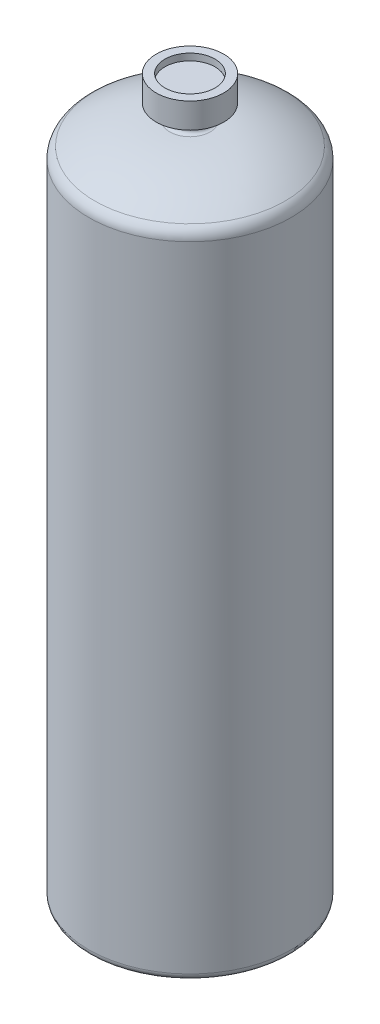
ISO-10303-21;
HEADER;
FILE_DESCRIPTION(('STEP AP214'),'2;1');
FILE_NAME('part.step','',(''),(''),'','','');
FILE_SCHEMA(('AUTOMOTIVE_DESIGN { 1 0 10303 214 1 1 1 1 }'));
ENDSEC;
DATA;
#1=APPLICATION_CONTEXT('core data for automotive mechanical design processes');
#2=APPLICATION_PROTOCOL_DEFINITION('international standard','automotive_design',2000,#1);
#3=PRODUCT_CONTEXT('',#1,'mechanical');
#4=PRODUCT('Part','Part','',(#3));
#5=PRODUCT_RELATED_PRODUCT_CATEGORY('part','',(#4));
#6=PRODUCT_DEFINITION_FORMATION('','',#4);
#7=PRODUCT_DEFINITION_CONTEXT('part definition',#1,'design');
#8=PRODUCT_DEFINITION('design','',#6,#7);
#9=PRODUCT_DEFINITION_SHAPE('','',#8);
#10=(LENGTH_UNIT() NAMED_UNIT(*) SI_UNIT(.MILLI.,.METRE.));
#11=(NAMED_UNIT(*) PLANE_ANGLE_UNIT() SI_UNIT($,.RADIAN.));
#12=(NAMED_UNIT(*) SI_UNIT($,.STERADIAN.) SOLID_ANGLE_UNIT());
#13=UNCERTAINTY_MEASURE_WITH_UNIT(LENGTH_MEASURE(1.E-05),#10,'distance_accuracy_value','');
#14=(GEOMETRIC_REPRESENTATION_CONTEXT(3) GLOBAL_UNCERTAINTY_ASSIGNED_CONTEXT((#13)) GLOBAL_UNIT_ASSIGNED_CONTEXT((#10,
#11,#12)) REPRESENTATION_CONTEXT('',''));
#15=CARTESIAN_POINT('',(0.,0.,0.));
#16=DIRECTION('',(0.,0.,1.));
#17=DIRECTION('',(1.,0.,0.));
#18=AXIS2_PLACEMENT_3D('',#15,#16,#17);
#19=CARTESIAN_POINT('',(-12.7,269.24,0.));
#20=DIRECTION('',(0.,-1.,0.));
#21=DIRECTION('',(0.,0.,-1.));
#22=AXIS2_PLACEMENT_3D('',#19,#20,#21);
#23=PLANE('',#22);
#24=CARTESIAN_POINT('',(0.,269.24,0.));
#25=DIRECTION('',(0.,1.,0.));
#26=DIRECTION('',(0.,0.,1.));
#27=AXIS2_PLACEMENT_3D('',#24,#25,#26);
#28=CIRCLE('',#27,9.42682190489988);
#29=CARTESIAN_POINT('',(0.,269.24,9.42682190489988));
#30=VERTEX_POINT('',#29);
#31=EDGE_CURVE('E67',#30,#30,#28,.T.);
#32=ORIENTED_EDGE('',*,*,#31,.F.);
#33=EDGE_LOOP('',(#32));
#34=FACE_BOUND('',#33,.T.);
#35=CARTESIAN_POINT('',(0.,269.24,0.));
#36=DIRECTION('',(0.,-1.,0.));
#37=DIRECTION('',(0.,0.,-1.));
#38=AXIS2_PLACEMENT_3D('',#35,#36,#37);
#39=CIRCLE('',#38,12.7);
#40=CARTESIAN_POINT('',(0.,269.24,-12.7));
#41=VERTEX_POINT('',#40);
#42=EDGE_CURVE('E42',#41,#41,#39,.T.);
#43=ORIENTED_EDGE('',*,*,#42,.F.);
#44=EDGE_LOOP('',(#43));
#45=FACE_BOUND('',#44,.T.);
#46=ADVANCED_FACE('F31',(#34,#45),#23,.F.);
#47=CARTESIAN_POINT('',(0.,0.,0.));
#48=DIRECTION('',(0.,-1.,0.));
#49=DIRECTION('',(0.,0.,-1.));
#50=AXIS2_PLACEMENT_3D('',#47,#48,#49);
#51=CYLINDRICAL_SURFACE('',#50,12.7);
#52=CARTESIAN_POINT('',(0.,259.715,0.));
#53=DIRECTION('',(0.,-1.,0.));
#54=DIRECTION('',(0.,0.,-1.));
#55=AXIS2_PLACEMENT_3D('',#52,#53,#54);
#56=CIRCLE('',#55,12.7);
#57=CARTESIAN_POINT('',(0.,259.715,-12.7));
#58=VERTEX_POINT('',#57);
#59=EDGE_CURVE('E46',#58,#58,#56,.T.);
#60=ORIENTED_EDGE('',*,*,#59,.F.);
#61=EDGE_LOOP('',(#60));
#62=FACE_BOUND('',#61,.T.);
#63=ORIENTED_EDGE('',*,*,#42,.T.);
#64=EDGE_LOOP('',(#63));
#65=FACE_BOUND('',#64,.T.);
#66=ADVANCED_FACE('F83',(#62,#65),#51,.T.);
#67=CARTESIAN_POINT('',(-6.35,259.715,0.));
#68=DIRECTION('',(0.,1.,0.));
#69=DIRECTION('',(0.,0.,1.));
#70=AXIS2_PLACEMENT_3D('',#67,#68,#69);
#71=PLANE('',#70);
#72=CARTESIAN_POINT('',(0.,259.715,0.));
#73=DIRECTION('',(0.,-1.,0.));
#74=DIRECTION('',(0.,0.,-1.));
#75=AXIS2_PLACEMENT_3D('',#72,#73,#74);
#76=CIRCLE('',#75,6.35);
#77=CARTESIAN_POINT('',(0.,259.715,-6.35));
#78=VERTEX_POINT('',#77);
#79=EDGE_CURVE('E51',#78,#78,#76,.T.);
#80=ORIENTED_EDGE('',*,*,#79,.F.);
#81=EDGE_LOOP('',(#80));
#82=FACE_BOUND('',#81,.T.);
#83=ORIENTED_EDGE('',*,*,#59,.T.);
#84=EDGE_LOOP('',(#83));
#85=FACE_BOUND('',#84,.T.);
#86=ADVANCED_FACE('F87',(#82,#85),#71,.F.);
#87=CARTESIAN_POINT('',(0.,0.,0.));
#88=DIRECTION('',(0.,-1.,0.));
#89=DIRECTION('',(0.,0.,-1.));
#90=AXIS2_PLACEMENT_3D('',#87,#88,#89);
#91=CYLINDRICAL_SURFACE('',#90,6.35000000000001);
#92=CARTESIAN_POINT('',(0.,255.27,0.));
#93=DIRECTION('',(0.,-1.,0.));
#94=DIRECTION('',(0.,0.,-1.));
#95=AXIS2_PLACEMENT_3D('',#92,#93,#94);
#96=CIRCLE('',#95,6.35000000000001);
#97=CARTESIAN_POINT('',(0.,255.27,-6.35000000000001));
#98=VERTEX_POINT('',#97);
#99=EDGE_CURVE('E54',#98,#98,#96,.T.);
#100=ORIENTED_EDGE('',*,*,#99,.F.);
#101=EDGE_LOOP('',(#100));
#102=FACE_BOUND('',#101,.T.);
#103=ORIENTED_EDGE('',*,*,#79,.T.);
#104=EDGE_LOOP('',(#103));
#105=FACE_BOUND('',#104,.T.);
#106=ADVANCED_FACE('F93',(#102,#105),#91,.T.);
#107=CARTESIAN_POINT('',(0.,255.27,0.));
#108=DIRECTION('',(0.,-1.,0.));
#109=DIRECTION('',(0.,0.,-1.));
#110=AXIS2_PLACEMENT_3D('',#107,#108,#109);
#111=TOROIDAL_SURFACE('',#110,7.62,1.27);
#112=CARTESIAN_POINT('',(0.,254.,0.));
#113=DIRECTION('',(0.,-1.,0.));
#114=DIRECTION('',(0.,0.,-1.));
#115=AXIS2_PLACEMENT_3D('',#112,#113,#114);
#116=CIRCLE('',#115,7.62000000000001);
#117=CARTESIAN_POINT('',(0.,254.,-7.62000000000001));
#118=VERTEX_POINT('',#117);
#119=EDGE_CURVE('E57',#118,#118,#116,.T.);
#120=ORIENTED_EDGE('',*,*,#119,.F.);
#121=EDGE_LOOP('',(#120));
#122=FACE_BOUND('',#121,.T.);
#123=ORIENTED_EDGE('',*,*,#99,.T.);
#124=EDGE_LOOP('',(#123));
#125=FACE_BOUND('',#124,.T.);
#126=ADVANCED_FACE('F100',(#122,#125),#111,.F.);
#127=CARTESIAN_POINT('',(0.,202.776666666667,0.));
#128=DIRECTION('',(0.,-1.,0.));
#129=DIRECTION('',(0.,0.,-1.));
#130=AXIS2_PLACEMENT_3D('',#127,#128,#129);
#131=DEGENERATE_TOROIDAL_SURFACE('',#130,7.62000000000001,51.2233333333332,.T.);
#132=CARTESIAN_POINT('',(0.,245.541100917431,0.));
#133=DIRECTION('',(0.,-1.,0.));
#134=DIRECTION('',(0.,0.,-1.));
#135=AXIS2_PLACEMENT_3D('',#132,#133,#134);
#136=CIRCLE('',#135,35.8163302752294);
#137=CARTESIAN_POINT('',(0.,245.541100917431,-35.8163302752294));
#138=VERTEX_POINT('',#137);
#139=EDGE_CURVE('E60',#138,#138,#136,.T.);
#140=ORIENTED_EDGE('',*,*,#139,.F.);
#141=EDGE_LOOP('',(#140));
#142=FACE_BOUND('',#141,.T.);
#143=ORIENTED_EDGE('',*,*,#119,.T.);
#144=EDGE_LOOP('',(#143));
#145=FACE_BOUND('',#144,.T.);
#146=ADVANCED_FACE('F104',(#142,#145),#131,.T.);
#147=CARTESIAN_POINT('',(0.,241.3,0.));
#148=DIRECTION('',(0.,-1.,0.));
#149=DIRECTION('',(0.,0.,-1.));
#150=AXIS2_PLACEMENT_3D('',#147,#148,#149);
#151=TOROIDAL_SURFACE('',#150,33.02,5.07999999999997);
#152=CARTESIAN_POINT('',(0.,241.3,0.));
#153=DIRECTION('',(0.,-1.,0.));
#154=DIRECTION('',(0.,0.,-1.));
#155=AXIS2_PLACEMENT_3D('',#152,#153,#154);
#156=CIRCLE('',#155,38.1);
#157=CARTESIAN_POINT('',(0.,241.3,-38.1));
#158=VERTEX_POINT('',#157);
#159=EDGE_CURVE('E63',#158,#158,#156,.T.);
#160=ORIENTED_EDGE('',*,*,#159,.F.);
#161=EDGE_LOOP('',(#160));
#162=FACE_BOUND('',#161,.T.);
#163=ORIENTED_EDGE('',*,*,#139,.T.);
#164=EDGE_LOOP('',(#163));
#165=FACE_BOUND('',#164,.T.);
#166=ADVANCED_FACE('F108',(#162,#165),#151,.T.);
#167=CARTESIAN_POINT('',(0.,0.,0.));
#168=DIRECTION('',(0.,-1.,0.));
#169=DIRECTION('',(0.,0.,-1.));
#170=AXIS2_PLACEMENT_3D('',#167,#168,#169);
#171=CYLINDRICAL_SURFACE('',#170,38.1);
#172=CARTESIAN_POINT('',(0.,2.54,0.));
#173=DIRECTION('',(0.,1.,0.));
#174=DIRECTION('',(0.,0.,1.));
#175=AXIS2_PLACEMENT_3D('',#172,#173,#174);
#176=CIRCLE('',#175,38.1);
#177=CARTESIAN_POINT('',(0.,2.54,38.1));
#178=VERTEX_POINT('',#177);
#179=EDGE_CURVE('E10',#178,#178,#176,.T.);
#180=ORIENTED_EDGE('',*,*,#179,.T.);
#181=EDGE_LOOP('',(#180));
#182=FACE_BOUND('',#181,.T.);
#183=ORIENTED_EDGE('',*,*,#159,.T.);
#184=EDGE_LOOP('',(#183));
#185=FACE_BOUND('',#184,.T.);
#186=ADVANCED_FACE('F112',(#182,#185),#171,.T.);
#187=CARTESIAN_POINT('',(0.,0.,0.));
#188=DIRECTION('',(0.,1.,0.));
#189=DIRECTION('',(0.,0.,1.));
#190=AXIS2_PLACEMENT_3D('',#187,#188,#189);
#191=PLANE('',#190);
#192=CARTESIAN_POINT('',(0.,0.,0.));
#193=DIRECTION('',(0.,1.,0.));
#194=DIRECTION('',(0.,0.,1.));
#195=AXIS2_PLACEMENT_3D('',#192,#193,#194);
#196=CIRCLE('',#195,35.56);
#197=CARTESIAN_POINT('',(0.,0.,35.56));
#198=VERTEX_POINT('',#197);
#199=EDGE_CURVE('E38',#198,#198,#196,.F.);
#200=ORIENTED_EDGE('',*,*,#199,.T.);
#201=EDGE_LOOP('',(#200));
#202=FACE_BOUND('',#201,.T.);
#203=ADVANCED_FACE('F116',(#202),#191,.F.);
#204=CARTESIAN_POINT('',(0.,2.54,0.));
#205=DIRECTION('',(0.,1.,0.));
#206=DIRECTION('',(0.,0.,1.));
#207=AXIS2_PLACEMENT_3D('',#204,#205,#206);
#208=TOROIDAL_SURFACE('',#207,35.56,2.54);
#209=ORIENTED_EDGE('',*,*,#179,.F.);
#210=EDGE_LOOP('',(#209));
#211=FACE_BOUND('',#210,.T.);
#212=ORIENTED_EDGE('',*,*,#199,.F.);
#213=EDGE_LOOP('',(#212));
#214=FACE_BOUND('',#213,.T.);
#215=ADVANCED_FACE('F33',(#211,#214),#208,.T.);
#216=CARTESIAN_POINT('',(0.,266.7,0.));
#217=DIRECTION('',(0.,1.,0.));
#218=DIRECTION('',(0.,0.,1.));
#219=AXIS2_PLACEMENT_3D('',#216,#217,#218);
#220=CYLINDRICAL_SURFACE('',#219,9.42682190489988);
#221=CARTESIAN_POINT('',(0.,266.7,0.));
#222=DIRECTION('',(0.,1.,0.));
#223=DIRECTION('',(0.,0.,1.));
#224=AXIS2_PLACEMENT_3D('',#221,#222,#223);
#225=CIRCLE('',#224,9.42682190489988);
#226=CARTESIAN_POINT('',(0.,266.7,9.42682190489988));
#227=VERTEX_POINT('',#226);
#228=EDGE_CURVE('E66',#227,#227,#225,.T.);
#229=ORIENTED_EDGE('',*,*,#228,.F.);
#230=EDGE_LOOP('',(#229));
#231=FACE_BOUND('',#230,.T.);
#232=ORIENTED_EDGE('',*,*,#31,.T.);
#233=EDGE_LOOP('',(#232));
#234=FACE_BOUND('',#233,.T.);
#235=ADVANCED_FACE('F75',(#231,#234),#220,.F.);
#236=CARTESIAN_POINT('',(0.,266.7,0.));
#237=DIRECTION('',(0.,1.,0.));
#238=DIRECTION('',(0.,0.,1.));
#239=AXIS2_PLACEMENT_3D('',#236,#237,#238);
#240=PLANE('',#239);
#241=ORIENTED_EDGE('',*,*,#228,.T.);
#242=EDGE_LOOP('',(#241));
#243=FACE_BOUND('',#242,.T.);
#244=ADVANCED_FACE('F73',(#243),#240,.T.);
#245=CLOSED_SHELL('',(#46,#66,#86,#106,#126,#146,#166,#186,#203,#215,#235,#244));
#246=MANIFOLD_SOLID_BREP('B2',#245);
#247=ADVANCED_BREP_SHAPE_REPRESENTATION('',(#18,#246),#14);
#248=SHAPE_DEFINITION_REPRESENTATION(#9,#247);
ENDSEC;
END-ISO-10303-21;
